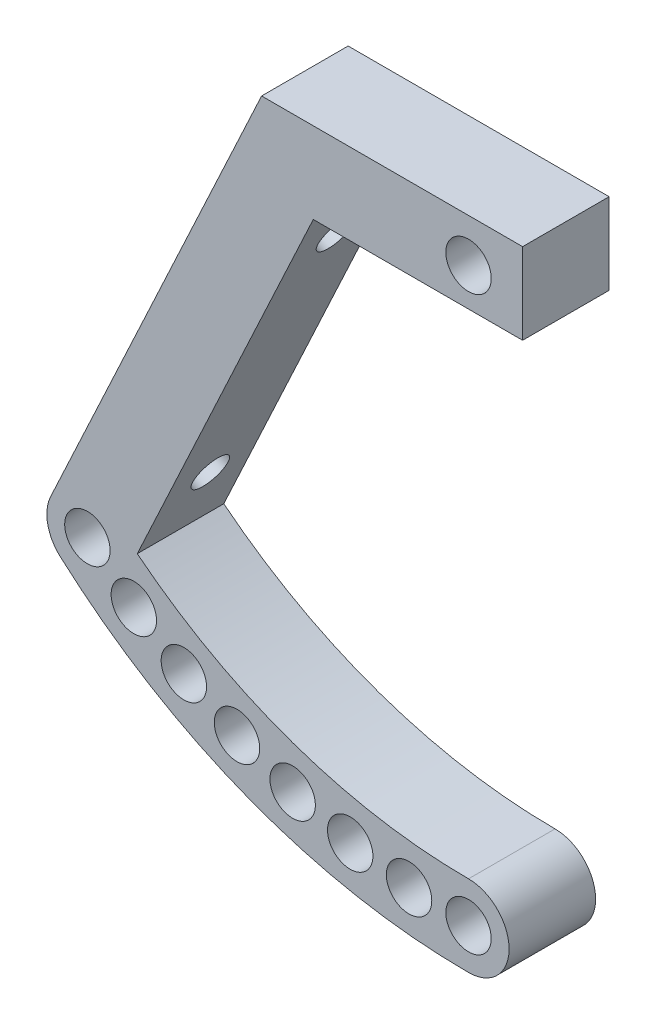
ISO-10303-21;
HEADER;
FILE_DESCRIPTION(('STEP AP214'),'2;1');
FILE_NAME('part.step','',(''),(''),'','','');
FILE_SCHEMA(('AUTOMOTIVE_DESIGN { 1 0 10303 214 1 1 1 1 }'));
ENDSEC;
DATA;
#1=APPLICATION_CONTEXT('core data for automotive mechanical design processes');
#2=APPLICATION_PROTOCOL_DEFINITION('international standard','automotive_design',2000,#1);
#3=PRODUCT_CONTEXT('',#1,'mechanical');
#4=PRODUCT('Part','Part','',(#3));
#5=PRODUCT_RELATED_PRODUCT_CATEGORY('part','',(#4));
#6=PRODUCT_DEFINITION_FORMATION('','',#4);
#7=PRODUCT_DEFINITION_CONTEXT('part definition',#1,'design');
#8=PRODUCT_DEFINITION('design','',#6,#7);
#9=PRODUCT_DEFINITION_SHAPE('','',#8);
#10=(LENGTH_UNIT() NAMED_UNIT(*) SI_UNIT(.MILLI.,.METRE.));
#11=(NAMED_UNIT(*) PLANE_ANGLE_UNIT() SI_UNIT($,.RADIAN.));
#12=(NAMED_UNIT(*) SI_UNIT($,.STERADIAN.) SOLID_ANGLE_UNIT());
#13=UNCERTAINTY_MEASURE_WITH_UNIT(LENGTH_MEASURE(1.E-05),#10,'distance_accuracy_value','');
#14=(GEOMETRIC_REPRESENTATION_CONTEXT(3) GLOBAL_UNCERTAINTY_ASSIGNED_CONTEXT((#13)) GLOBAL_UNIT_ASSIGNED_CONTEXT((#10,
#11,#12)) REPRESENTATION_CONTEXT('',''));
#15=CARTESIAN_POINT('',(0.,0.,0.));
#16=DIRECTION('',(0.,0.,1.));
#17=DIRECTION('',(1.,0.,0.));
#18=AXIS2_PLACEMENT_3D('',#15,#16,#17);
#19=CARTESIAN_POINT('',(-46.3566792332797,21.616474533113,8.));
#20=DIRECTION('',(0.906307787036651,-0.422618261740697,0.));
#21=DIRECTION('',(0.422618261740697,0.906307787036651,0.));
#22=AXIS2_PLACEMENT_3D('',#19,#20,#21);
#23=PLANE('',#22);
#24=CARTESIAN_POINT('',(-23.094691175394,71.5019689080599,4.));
#25=DIRECTION('',(-0.906307787036651,0.422618261740697,0.));
#26=DIRECTION('',(-0.422618261740697,-0.906307787036651,0.));
#27=AXIS2_PLACEMENT_3D('',#24,#25,#26);
#28=CIRCLE('',#27,1.65);
#29=CARTESIAN_POINT('',(-23.7920113072661,70.0065610594495,4.));
#30=VERTEX_POINT('',#29);
#31=EDGE_CURVE('E170',#30,#30,#28,.T.);
#32=ORIENTED_EDGE('',*,*,#31,.F.);
#33=EDGE_LOOP('',(#32));
#34=FACE_BOUND('',#33,.T.);
#35=CARTESIAN_POINT('',(-34.6744315470891,46.6691355432557,4.));
#36=DIRECTION('',(-0.906307787036651,0.422618261740697,0.));
#37=DIRECTION('',(-0.422618261740697,-0.906307787036651,0.));
#38=AXIS2_PLACEMENT_3D('',#35,#36,#37);
#39=CIRCLE('',#38,1.65);
#40=CARTESIAN_POINT('',(-35.3717516789612,45.1737276946452,4.));
#41=VERTEX_POINT('',#40);
#42=EDGE_CURVE('E253',#41,#41,#39,.T.);
#43=ORIENTED_EDGE('',*,*,#42,.F.);
#44=EDGE_LOOP('',(#43));
#45=FACE_BOUND('',#44,.T.);
#46=DIRECTION('',(-0.422618261740697,-0.906307787036651,0.));
#47=VECTOR('',#46,1.);
#48=CARTESIAN_POINT('',(-46.3566792332797,21.616474533113,0.));
#49=LINE('',#48,#47);
#50=CARTESIAN_POINT('',(-19.131994197983,80.,0.));
#51=VERTEX_POINT('',#50);
#52=CARTESIAN_POINT('',(-38.6371285245,38.1711044513156,0.));
#53=VERTEX_POINT('',#52);
#54=EDGE_CURVE('E169',#51,#53,#49,.T.);
#55=ORIENTED_EDGE('',*,*,#54,.T.);
#56=DIRECTION('',(0.,0.,-1.));
#57=VECTOR('',#56,1.);
#58=CARTESIAN_POINT('',(-38.6371285245,38.1711044513156,8.));
#59=LINE('',#58,#57);
#60=CARTESIAN_POINT('',(-38.6371285245,38.1711044513156,8.));
#61=VERTEX_POINT('',#60);
#62=EDGE_CURVE('E11',#61,#53,#59,.T.);
#63=ORIENTED_EDGE('',*,*,#62,.F.);
#64=DIRECTION('',(-0.422618261740697,-0.906307787036651,0.));
#65=VECTOR('',#64,1.);
#66=CARTESIAN_POINT('',(-46.3566792332797,21.616474533113,8.));
#67=LINE('',#66,#65);
#68=CARTESIAN_POINT('',(-19.131994197983,80.,8.));
#69=VERTEX_POINT('',#68);
#70=EDGE_CURVE('E246',#69,#61,#67,.T.);
#71=ORIENTED_EDGE('',*,*,#70,.F.);
#72=DIRECTION('',(0.,0.,-1.));
#73=VECTOR('',#72,1.);
#74=CARTESIAN_POINT('',(-19.131994197983,80.,8.));
#75=LINE('',#74,#73);
#76=EDGE_CURVE('E165',#69,#51,#75,.T.);
#77=ORIENTED_EDGE('',*,*,#76,.T.);
#78=EDGE_LOOP('',(#55,#63,#71,#77));
#79=FACE_BOUND('',#78,.T.);
#80=ADVANCED_FACE('F36',(#34,#45,#79),#23,.F.);
#81=CARTESIAN_POINT('',(-35.2384743231125,36.586285969788,8.));
#82=DIRECTION('',(0.,0.,-1.));
#83=DIRECTION('',(-1.,0.,0.));
#84=AXIS2_PLACEMENT_3D('',#81,#82,#83);
#85=CYLINDRICAL_SURFACE('',#84,3.75);
#86=CARTESIAN_POINT('',(-35.2384743231125,36.586285969788,0.));
#87=DIRECTION('',(0.,0.,1.));
#88=DIRECTION('',(1.,0.,0.));
#89=AXIS2_PLACEMENT_3D('',#86,#87,#88);
#90=CIRCLE('',#89,3.75);
#91=CARTESIAN_POINT('',(-37.7379138053234,33.7906997567076,0.));
#92=VERTEX_POINT('',#91);
#93=EDGE_CURVE('E173',#53,#92,#90,.T.);
#94=ORIENTED_EDGE('',*,*,#93,.T.);
#95=DIRECTION('',(0.,0.,-1.));
#96=VECTOR('',#95,1.);
#97=CARTESIAN_POINT('',(-37.7379138053234,33.7906997567076,8.));
#98=LINE('',#97,#96);
#99=CARTESIAN_POINT('',(-37.7379138053234,33.7906997567076,8.));
#100=VERTEX_POINT('',#99);
#101=EDGE_CURVE('E45',#100,#92,#98,.T.);
#102=ORIENTED_EDGE('',*,*,#101,.F.);
#103=CARTESIAN_POINT('',(-35.2384743231125,36.586285969788,8.));
#104=DIRECTION('',(0.,0.,1.));
#105=DIRECTION('',(1.,0.,0.));
#106=AXIS2_PLACEMENT_3D('',#103,#104,#105);
#107=CIRCLE('',#106,3.75);
#108=EDGE_CURVE('E98',#61,#100,#107,.T.);
#109=ORIENTED_EDGE('',*,*,#108,.F.);
#110=ORIENTED_EDGE('',*,*,#62,.T.);
#111=EDGE_LOOP('',(#94,#102,#109,#110));
#112=FACE_BOUND('',#111,.T.);
#113=ADVANCED_FACE('F266',(#112),#85,.T.);
#114=CARTESIAN_POINT('',(0.,76.,8.));
#115=DIRECTION('',(0.,0.,-1.));
#116=DIRECTION('',(-1.,0.,0.));
#117=AXIS2_PLACEMENT_3D('',#114,#115,#116);
#118=CYLINDRICAL_SURFACE('',#117,56.6195652173913);
#119=CARTESIAN_POINT('',(0.,76.,0.));
#120=DIRECTION('',(0.,0.,1.));
#121=DIRECTION('',(1.,0.,0.));
#122=AXIS2_PLACEMENT_3D('',#119,#120,#121);
#123=CIRCLE('',#122,56.6195652173913);
#124=CARTESIAN_POINT('',(-6.22100093414468E-13,19.3804347826087,0.));
#125=VERTEX_POINT('',#124);
#126=EDGE_CURVE('E175',#92,#125,#123,.T.);
#127=ORIENTED_EDGE('',*,*,#126,.T.);
#128=DIRECTION('',(0.,0.,-1.));
#129=VECTOR('',#128,1.);
#130=CARTESIAN_POINT('',(-6.22100093414468E-13,19.3804347826087,8.));
#131=LINE('',#130,#129);
#132=CARTESIAN_POINT('',(-6.22100093414468E-13,19.3804347826087,8.));
#133=VERTEX_POINT('',#132);
#134=EDGE_CURVE('E221',#133,#125,#131,.T.);
#135=ORIENTED_EDGE('',*,*,#134,.F.);
#136=CARTESIAN_POINT('',(0.,76.,8.));
#137=DIRECTION('',(0.,0.,1.));
#138=DIRECTION('',(1.,0.,0.));
#139=AXIS2_PLACEMENT_3D('',#136,#137,#138);
#140=CIRCLE('',#139,56.6195652173913);
#141=EDGE_CURVE('E229',#100,#133,#140,.T.);
#142=ORIENTED_EDGE('',*,*,#141,.F.);
#143=ORIENTED_EDGE('',*,*,#101,.T.);
#144=EDGE_LOOP('',(#127,#135,#142,#143));
#145=FACE_BOUND('',#144,.T.);
#146=ADVANCED_FACE('F227',(#145),#118,.T.);
#147=CARTESIAN_POINT('',(-5.50774703622636E-13,23.1304347826087,8.));
#148=DIRECTION('',(0.,0.,-1.));
#149=DIRECTION('',(-1.,0.,0.));
#150=AXIS2_PLACEMENT_3D('',#147,#148,#149);
#151=CYLINDRICAL_SURFACE('',#150,3.74999999999999);
#152=CARTESIAN_POINT('',(-5.50774703622636E-13,23.1304347826087,0.));
#153=DIRECTION('',(0.,0.,1.));
#154=DIRECTION('',(1.,0.,0.));
#155=AXIS2_PLACEMENT_3D('',#152,#153,#154);
#156=CIRCLE('',#155,3.74999999999999);
#157=CARTESIAN_POINT('',(-5.40786307992416E-13,26.8804347826087,0.));
#158=VERTEX_POINT('',#157);
#159=EDGE_CURVE('E177',#125,#158,#156,.T.);
#160=ORIENTED_EDGE('',*,*,#159,.T.);
#161=DIRECTION('',(0.,0.,-1.));
#162=VECTOR('',#161,1.);
#163=CARTESIAN_POINT('',(-5.40786307992416E-13,26.8804347826087,8.));
#164=LINE('',#163,#162);
#165=CARTESIAN_POINT('',(-5.40786307992416E-13,26.8804347826087,8.));
#166=VERTEX_POINT('',#165);
#167=EDGE_CURVE('E219',#166,#158,#164,.T.);
#168=ORIENTED_EDGE('',*,*,#167,.F.);
#169=CARTESIAN_POINT('',(-5.50774703622636E-13,23.1304347826087,8.));
#170=DIRECTION('',(0.,0.,1.));
#171=DIRECTION('',(1.,0.,0.));
#172=AXIS2_PLACEMENT_3D('',#169,#170,#171);
#173=CIRCLE('',#172,3.74999999999999);
#174=EDGE_CURVE('E241',#133,#166,#173,.T.);
#175=ORIENTED_EDGE('',*,*,#174,.F.);
#176=ORIENTED_EDGE('',*,*,#134,.T.);
#177=EDGE_LOOP('',(#160,#168,#175,#176));
#178=FACE_BOUND('',#177,.T.);
#179=ADVANCED_FACE('F238',(#178),#151,.T.);
#180=CARTESIAN_POINT('',(0.,76.,8.));
#181=DIRECTION('',(0.,0.,-1.));
#182=DIRECTION('',(-1.,0.,0.));
#183=AXIS2_PLACEMENT_3D('',#180,#181,#182);
#184=CYLINDRICAL_SURFACE('',#183,49.1195652173913);
#185=CARTESIAN_POINT('',(0.,76.,0.));
#186=DIRECTION('',(0.,0.,1.));
#187=DIRECTION('',(1.,0.,0.));
#188=AXIS2_PLACEMENT_3D('',#185,#186,#187);
#189=CIRCLE('',#188,49.1195652173913);
#190=CARTESIAN_POINT('',(-30.6285068063964,37.5991372758881,0.));
#191=VERTEX_POINT('',#190);
#192=EDGE_CURVE('E180',#191,#158,#189,.T.);
#193=ORIENTED_EDGE('',*,*,#192,.F.);
#194=DIRECTION('',(0.,0.,-1.));
#195=VECTOR('',#194,1.);
#196=CARTESIAN_POINT('',(-30.6285068063964,37.5991372758881,8.));
#197=LINE('',#196,#195);
#198=CARTESIAN_POINT('',(-30.6285068063964,37.5991372758881,8.));
#199=VERTEX_POINT('',#198);
#200=EDGE_CURVE('E217',#199,#191,#197,.T.);
#201=ORIENTED_EDGE('',*,*,#200,.F.);
#202=CARTESIAN_POINT('',(0.,76.,8.));
#203=DIRECTION('',(0.,0.,1.));
#204=DIRECTION('',(1.,0.,0.));
#205=AXIS2_PLACEMENT_3D('',#202,#203,#204);
#206=CIRCLE('',#205,49.1195652173913);
#207=EDGE_CURVE('E136',#199,#166,#206,.T.);
#208=ORIENTED_EDGE('',*,*,#207,.T.);
#209=ORIENTED_EDGE('',*,*,#167,.T.);
#210=EDGE_LOOP('',(#193,#201,#208,#209));
#211=FACE_BOUND('',#210,.T.);
#212=ADVANCED_FACE('F275',(#211),#184,.F.);
#213=CARTESIAN_POINT('',(-39.5593708305048,18.4468375700577,8.));
#214=DIRECTION('',(0.906307787036651,-0.422618261740697,0.));
#215=DIRECTION('',(0.422618261740697,0.906307787036651,0.));
#216=AXIS2_PLACEMENT_3D('',#213,#214,#215);
#217=PLANE('',#216);
#218=CARTESIAN_POINT('',(-16.2973827726191,68.3323319450047,4.));
#219=DIRECTION('',(0.906307787036651,-0.422618261740697,0.));
#220=DIRECTION('',(0.422618261740697,0.906307787036651,0.));
#221=AXIS2_PLACEMENT_3D('',#218,#219,#220);
#222=CIRCLE('',#221,1.65);
#223=CARTESIAN_POINT('',(-15.6000626407469,69.8277397936152,4.));
#224=VERTEX_POINT('',#223);
#225=EDGE_CURVE('E256',#224,#224,#222,.F.);
#226=ORIENTED_EDGE('',*,*,#225,.T.);
#227=EDGE_LOOP('',(#226));
#228=FACE_BOUND('',#227,.T.);
#229=CARTESIAN_POINT('',(-27.8771231443142,43.4994985802004,4.));
#230=DIRECTION('',(0.906307787036651,-0.422618261740697,0.));
#231=DIRECTION('',(0.422618261740697,0.906307787036651,0.));
#232=AXIS2_PLACEMENT_3D('',#229,#230,#231);
#233=CIRCLE('',#232,1.65);
#234=CARTESIAN_POINT('',(-27.179803012442,44.9949064288109,4.));
#235=VERTEX_POINT('',#234);
#236=EDGE_CURVE('E250',#235,#235,#233,.F.);
#237=ORIENTED_EDGE('',*,*,#236,.T.);
#238=EDGE_LOOP('',(#237));
#239=FACE_BOUND('',#238,.T.);
#240=DIRECTION('',(-0.422618261740697,-0.906307787036651,0.));
#241=VECTOR('',#240,1.);
#242=CARTESIAN_POINT('',(-39.5593708305048,18.4468375700577,0.));
#243=LINE('',#242,#241);
#244=CARTESIAN_POINT('',(-14.3539672419268,72.5,0.));
#245=VERTEX_POINT('',#244);
#246=EDGE_CURVE('E183',#245,#191,#243,.T.);
#247=ORIENTED_EDGE('',*,*,#246,.F.);
#248=DIRECTION('',(0.,0.,-1.));
#249=VECTOR('',#248,1.);
#250=CARTESIAN_POINT('',(-14.3539672419268,72.5,8.));
#251=LINE('',#250,#249);
#252=CARTESIAN_POINT('',(-14.3539672419268,72.5,8.));
#253=VERTEX_POINT('',#252);
#254=EDGE_CURVE('E123',#253,#245,#251,.T.);
#255=ORIENTED_EDGE('',*,*,#254,.F.);
#256=DIRECTION('',(-0.422618261740697,-0.906307787036651,0.));
#257=VECTOR('',#256,1.);
#258=CARTESIAN_POINT('',(-39.5593708305048,18.4468375700577,8.));
#259=LINE('',#258,#257);
#260=EDGE_CURVE('E134',#253,#199,#259,.T.);
#261=ORIENTED_EDGE('',*,*,#260,.T.);
#262=ORIENTED_EDGE('',*,*,#200,.T.);
#263=EDGE_LOOP('',(#247,#255,#261,#262));
#264=FACE_BOUND('',#263,.T.);
#265=ADVANCED_FACE('F273',(#228,#239,#264),#217,.T.);
#266=CARTESIAN_POINT('',(0.,72.5,8.));
#267=DIRECTION('',(0.,-1.,0.));
#268=DIRECTION('',(0.,0.,-1.));
#269=AXIS2_PLACEMENT_3D('',#266,#267,#268);
#270=PLANE('',#269);
#271=DIRECTION('',(-1.,0.,0.));
#272=VECTOR('',#271,1.);
#273=CARTESIAN_POINT('',(0.,72.5,0.));
#274=LINE('',#273,#272);
#275=CARTESIAN_POINT('',(5.00000000000002,72.5,0.));
#276=VERTEX_POINT('',#275);
#277=EDGE_CURVE('E122',#276,#245,#274,.T.);
#278=ORIENTED_EDGE('',*,*,#277,.F.);
#279=DIRECTION('',(0.,0.,-1.));
#280=VECTOR('',#279,1.);
#281=CARTESIAN_POINT('',(5.00000000000002,72.5,8.));
#282=LINE('',#281,#280);
#283=CARTESIAN_POINT('',(5.00000000000002,72.5,8.));
#284=VERTEX_POINT('',#283);
#285=EDGE_CURVE('E116',#284,#276,#282,.T.);
#286=ORIENTED_EDGE('',*,*,#285,.F.);
#287=DIRECTION('',(-1.,0.,0.));
#288=VECTOR('',#287,1.);
#289=CARTESIAN_POINT('',(0.,72.5,8.));
#290=LINE('',#289,#288);
#291=EDGE_CURVE('E120',#284,#253,#290,.T.);
#292=ORIENTED_EDGE('',*,*,#291,.T.);
#293=ORIENTED_EDGE('',*,*,#254,.T.);
#294=EDGE_LOOP('',(#278,#286,#292,#293));
#295=FACE_BOUND('',#294,.T.);
#296=ADVANCED_FACE('F118',(#295),#270,.T.);
#297=CARTESIAN_POINT('',(5.00000000000004,0.,8.));
#298=DIRECTION('',(-1.,0.,0.));
#299=DIRECTION('',(0.,-1.,0.));
#300=AXIS2_PLACEMENT_3D('',#297,#298,#299);
#301=PLANE('',#300);
#302=DIRECTION('',(0.,1.,0.));
#303=VECTOR('',#302,1.);
#304=CARTESIAN_POINT('',(5.00000000000004,0.,0.));
#305=LINE('',#304,#303);
#306=CARTESIAN_POINT('',(5.00000000000002,80.,0.));
#307=VERTEX_POINT('',#306);
#308=EDGE_CURVE('E84',#276,#307,#305,.T.);
#309=ORIENTED_EDGE('',*,*,#308,.T.);
#310=DIRECTION('',(0.,0.,-1.));
#311=VECTOR('',#310,1.);
#312=CARTESIAN_POINT('',(5.00000000000002,80.,8.));
#313=LINE('',#312,#311);
#314=CARTESIAN_POINT('',(5.00000000000002,80.,8.));
#315=VERTEX_POINT('',#314);
#316=EDGE_CURVE('E124',#315,#307,#313,.T.);
#317=ORIENTED_EDGE('',*,*,#316,.F.);
#318=DIRECTION('',(0.,1.,0.));
#319=VECTOR('',#318,1.);
#320=CARTESIAN_POINT('',(5.00000000000004,0.,8.));
#321=LINE('',#320,#319);
#322=EDGE_CURVE('E126',#284,#315,#321,.T.);
#323=ORIENTED_EDGE('',*,*,#322,.F.);
#324=ORIENTED_EDGE('',*,*,#285,.T.);
#325=EDGE_LOOP('',(#309,#317,#323,#324));
#326=FACE_BOUND('',#325,.T.);
#327=ADVANCED_FACE('F127',(#326),#301,.F.);
#328=CARTESIAN_POINT('',(-5.5,23.4172944184498,8.));
#329=DIRECTION('',(0.,0.,-1.));
#330=DIRECTION('',(-1.,0.,0.));
#331=AXIS2_PLACEMENT_3D('',#328,#329,#330);
#332=CYLINDRICAL_SURFACE('',#331,2.1);
#333=CARTESIAN_POINT('',(-5.5,23.4172944184498,8.));
#334=DIRECTION('',(0.,0.,1.));
#335=DIRECTION('',(1.,0.,0.));
#336=AXIS2_PLACEMENT_3D('',#333,#334,#335);
#337=CIRCLE('',#336,2.1);
#338=CARTESIAN_POINT('',(-3.39999999999999,23.4172944184498,8.));
#339=VERTEX_POINT('',#338);
#340=EDGE_CURVE('E159',#339,#339,#337,.T.);
#341=ORIENTED_EDGE('',*,*,#340,.T.);
#342=EDGE_LOOP('',(#341));
#343=FACE_BOUND('',#342,.T.);
#344=CARTESIAN_POINT('',(-5.5,23.4172944184498,0.));
#345=DIRECTION('',(0.,0.,1.));
#346=DIRECTION('',(1.,0.,0.));
#347=AXIS2_PLACEMENT_3D('',#344,#345,#346);
#348=CIRCLE('',#347,2.1);
#349=CARTESIAN_POINT('',(-3.39999999999999,23.4172944184498,0.));
#350=VERTEX_POINT('',#349);
#351=EDGE_CURVE('E207',#350,#350,#348,.T.);
#352=ORIENTED_EDGE('',*,*,#351,.F.);
#353=EDGE_LOOP('',(#352));
#354=FACE_BOUND('',#353,.T.);
#355=ADVANCED_FACE('F323',(#343,#354),#332,.F.);
#356=CARTESIAN_POINT('',(-10.940316210635,24.2747604405034,8.));
#357=DIRECTION('',(0.,0.,-1.));
#358=DIRECTION('',(-1.,0.,0.));
#359=AXIS2_PLACEMENT_3D('',#356,#357,#358);
#360=CYLINDRICAL_SURFACE('',#359,2.1);
#361=CARTESIAN_POINT('',(-10.940316210635,24.2747604405034,8.));
#362=DIRECTION('',(0.,0.,1.));
#363=DIRECTION('',(1.,0.,0.));
#364=AXIS2_PLACEMENT_3D('',#361,#362,#363);
#365=CIRCLE('',#364,2.1);
#366=CARTESIAN_POINT('',(-8.84031621063503,24.2747604405034,8.));
#367=VERTEX_POINT('',#366);
#368=EDGE_CURVE('E156',#367,#367,#365,.T.);
#369=ORIENTED_EDGE('',*,*,#368,.T.);
#370=EDGE_LOOP('',(#369));
#371=FACE_BOUND('',#370,.T.);
#372=CARTESIAN_POINT('',(-10.940316210635,24.2747604405034,0.));
#373=DIRECTION('',(0.,0.,1.));
#374=DIRECTION('',(1.,0.,0.));
#375=AXIS2_PLACEMENT_3D('',#372,#373,#374);
#376=CIRCLE('',#375,2.1);
#377=CARTESIAN_POINT('',(-8.84031621063503,24.2747604405034,0.));
#378=VERTEX_POINT('',#377);
#379=EDGE_CURVE('E204',#378,#378,#376,.T.);
#380=ORIENTED_EDGE('',*,*,#379,.F.);
#381=EDGE_LOOP('',(#380));
#382=FACE_BOUND('',#381,.T.);
#383=ADVANCED_FACE('F332',(#371,#382),#360,.F.);
#384=CARTESIAN_POINT('',(-16.2619125070334,25.6935279721428,8.));
#385=DIRECTION('',(0.,0.,-1.));
#386=DIRECTION('',(-1.,0.,0.));
#387=AXIS2_PLACEMENT_3D('',#384,#385,#386);
#388=CYLINDRICAL_SURFACE('',#387,2.1);
#389=CARTESIAN_POINT('',(-16.2619125070334,25.6935279721428,8.));
#390=DIRECTION('',(0.,0.,1.));
#391=DIRECTION('',(1.,0.,0.));
#392=AXIS2_PLACEMENT_3D('',#389,#390,#391);
#393=CIRCLE('',#392,2.1);
#394=CARTESIAN_POINT('',(-14.1619125070334,25.6935279721428,8.));
#395=VERTEX_POINT('',#394);
#396=EDGE_CURVE('E153',#395,#395,#393,.T.);
#397=ORIENTED_EDGE('',*,*,#396,.T.);
#398=EDGE_LOOP('',(#397));
#399=FACE_BOUND('',#398,.T.);
#400=CARTESIAN_POINT('',(-16.2619125070334,25.6935279721428,0.));
#401=DIRECTION('',(0.,0.,1.));
#402=DIRECTION('',(1.,0.,0.));
#403=AXIS2_PLACEMENT_3D('',#400,#401,#402);
#404=CIRCLE('',#403,2.1);
#405=CARTESIAN_POINT('',(-14.1619125070334,25.6935279721428,0.));
#406=VERTEX_POINT('',#405);
#407=EDGE_CURVE('E201',#406,#406,#404,.T.);
#408=ORIENTED_EDGE('',*,*,#407,.F.);
#409=EDGE_LOOP('',(#408));
#410=FACE_BOUND('',#409,.T.);
#411=ADVANCED_FACE('F342',(#399,#410),#388,.F.);
#412=CARTESIAN_POINT('',(-21.4070410651152,27.6582011183648,8.));
#413=DIRECTION('',(0.,0.,-1.));
#414=DIRECTION('',(-1.,0.,0.));
#415=AXIS2_PLACEMENT_3D('',#412,#413,#414);
#416=CYLINDRICAL_SURFACE('',#415,2.1);
#417=CARTESIAN_POINT('',(-21.4070410651152,27.6582011183648,8.));
#418=DIRECTION('',(0.,0.,1.));
#419=DIRECTION('',(1.,0.,0.));
#420=AXIS2_PLACEMENT_3D('',#417,#418,#419);
#421=CIRCLE('',#420,2.1);
#422=CARTESIAN_POINT('',(-19.3070410651152,27.6582011183648,8.));
#423=VERTEX_POINT('',#422);
#424=EDGE_CURVE('E150',#423,#423,#421,.T.);
#425=ORIENTED_EDGE('',*,*,#424,.T.);
#426=EDGE_LOOP('',(#425));
#427=FACE_BOUND('',#426,.T.);
#428=CARTESIAN_POINT('',(-21.4070410651152,27.6582011183648,0.));
#429=DIRECTION('',(0.,0.,1.));
#430=DIRECTION('',(1.,0.,0.));
#431=AXIS2_PLACEMENT_3D('',#428,#429,#430);
#432=CIRCLE('',#431,2.1);
#433=CARTESIAN_POINT('',(-19.3070410651152,27.6582011183648,0.));
#434=VERTEX_POINT('',#433);
#435=EDGE_CURVE('E198',#434,#434,#432,.T.);
#436=ORIENTED_EDGE('',*,*,#435,.F.);
#437=EDGE_LOOP('',(#436));
#438=FACE_BOUND('',#437,.T.);
#439=ADVANCED_FACE('F352',(#427,#438),#416,.F.);
#440=CARTESIAN_POINT('',(-26.3198690177684,30.1474600358551,8.));
#441=DIRECTION('',(0.,0.,-1.));
#442=DIRECTION('',(-1.,0.,0.));
#443=AXIS2_PLACEMENT_3D('',#440,#441,#442);
#444=CYLINDRICAL_SURFACE('',#443,2.10000000000001);
#445=CARTESIAN_POINT('',(-26.3198690177684,30.1474600358551,8.));
#446=DIRECTION('',(0.,0.,1.));
#447=DIRECTION('',(1.,0.,0.));
#448=AXIS2_PLACEMENT_3D('',#445,#446,#447);
#449=CIRCLE('',#448,2.10000000000001);
#450=CARTESIAN_POINT('',(-24.2198690177684,30.1474600358551,8.));
#451=VERTEX_POINT('',#450);
#452=EDGE_CURVE('E147',#451,#451,#449,.T.);
#453=ORIENTED_EDGE('',*,*,#452,.T.);
#454=EDGE_LOOP('',(#453));
#455=FACE_BOUND('',#454,.T.);
#456=CARTESIAN_POINT('',(-26.3198690177684,30.1474600358551,0.));
#457=DIRECTION('',(0.,0.,1.));
#458=DIRECTION('',(1.,0.,0.));
#459=AXIS2_PLACEMENT_3D('',#456,#457,#458);
#460=CIRCLE('',#459,2.10000000000001);
#461=CARTESIAN_POINT('',(-24.2198690177684,30.1474600358551,0.));
#462=VERTEX_POINT('',#461);
#463=EDGE_CURVE('E195',#462,#462,#460,.T.);
#464=ORIENTED_EDGE('',*,*,#463,.F.);
#465=EDGE_LOOP('',(#464));
#466=FACE_BOUND('',#465,.T.);
#467=ADVANCED_FACE('F362',(#455,#466),#444,.F.);
#468=CARTESIAN_POINT('',(-35.2384743231125,36.586285969788,8.));
#469=DIRECTION('',(0.,0.,-1.));
#470=DIRECTION('',(-1.,0.,0.));
#471=AXIS2_PLACEMENT_3D('',#468,#469,#470);
#472=CYLINDRICAL_SURFACE('',#471,2.1);
#473=CARTESIAN_POINT('',(-35.2384743231125,36.586285969788,8.));
#474=DIRECTION('',(0.,0.,1.));
#475=DIRECTION('',(1.,0.,0.));
#476=AXIS2_PLACEMENT_3D('',#473,#474,#475);
#477=CIRCLE('',#476,2.1);
#478=CARTESIAN_POINT('',(-33.1384743231125,36.586285969788,8.));
#479=VERTEX_POINT('',#478);
#480=EDGE_CURVE('E144',#479,#479,#477,.T.);
#481=ORIENTED_EDGE('',*,*,#480,.T.);
#482=EDGE_LOOP('',(#481));
#483=FACE_BOUND('',#482,.T.);
#484=CARTESIAN_POINT('',(-35.2384743231125,36.586285969788,0.));
#485=DIRECTION('',(0.,0.,1.));
#486=DIRECTION('',(1.,0.,0.));
#487=AXIS2_PLACEMENT_3D('',#484,#485,#486);
#488=CIRCLE('',#487,2.1);
#489=CARTESIAN_POINT('',(-33.1384743231125,36.586285969788,0.));
#490=VERTEX_POINT('',#489);
#491=EDGE_CURVE('E192',#490,#490,#488,.T.);
#492=ORIENTED_EDGE('',*,*,#491,.F.);
#493=EDGE_LOOP('',(#492));
#494=FACE_BOUND('',#493,.T.);
#495=ADVANCED_FACE('F372',(#483,#494),#472,.F.);
#496=CARTESIAN_POINT('',(0.,76.,8.));
#497=DIRECTION('',(0.,0.,-1.));
#498=DIRECTION('',(-1.,0.,0.));
#499=AXIS2_PLACEMENT_3D('',#496,#497,#498);
#500=CYLINDRICAL_SURFACE('',#499,2.09999999999985);
#501=CARTESIAN_POINT('',(0.,76.,8.));
#502=DIRECTION('',(0.,0.,1.));
#503=DIRECTION('',(1.,0.,0.));
#504=AXIS2_PLACEMENT_3D('',#501,#502,#503);
#505=CIRCLE('',#504,2.09999999999985);
#506=CARTESIAN_POINT('',(2.09999999999985,76.,8.));
#507=VERTEX_POINT('',#506);
#508=EDGE_CURVE('E141',#507,#507,#505,.T.);
#509=ORIENTED_EDGE('',*,*,#508,.T.);
#510=EDGE_LOOP('',(#509));
#511=FACE_BOUND('',#510,.T.);
#512=CARTESIAN_POINT('',(0.,76.,0.));
#513=DIRECTION('',(0.,0.,1.));
#514=DIRECTION('',(1.,0.,0.));
#515=AXIS2_PLACEMENT_3D('',#512,#513,#514);
#516=CIRCLE('',#515,2.09999999999985);
#517=CARTESIAN_POINT('',(2.09999999999985,76.,0.));
#518=VERTEX_POINT('',#517);
#519=EDGE_CURVE('E189',#518,#518,#516,.T.);
#520=ORIENTED_EDGE('',*,*,#519,.F.);
#521=EDGE_LOOP('',(#520));
#522=FACE_BOUND('',#521,.T.);
#523=ADVANCED_FACE('F382',(#511,#522),#500,.F.);
#524=CARTESIAN_POINT('',(0.,80.,8.));
#525=DIRECTION('',(0.,-1.,0.));
#526=DIRECTION('',(0.,0.,-1.));
#527=AXIS2_PLACEMENT_3D('',#524,#525,#526);
#528=PLANE('',#527);
#529=DIRECTION('',(-1.,0.,0.));
#530=VECTOR('',#529,1.);
#531=CARTESIAN_POINT('',(0.,80.,0.));
#532=LINE('',#531,#530);
#533=EDGE_CURVE('E90',#307,#51,#532,.T.);
#534=ORIENTED_EDGE('',*,*,#533,.T.);
#535=ORIENTED_EDGE('',*,*,#76,.F.);
#536=DIRECTION('',(-1.,0.,0.));
#537=VECTOR('',#536,1.);
#538=CARTESIAN_POINT('',(0.,80.,8.));
#539=LINE('',#538,#537);
#540=EDGE_CURVE('E53',#315,#69,#539,.T.);
#541=ORIENTED_EDGE('',*,*,#540,.F.);
#542=ORIENTED_EDGE('',*,*,#316,.T.);
#543=EDGE_LOOP('',(#534,#535,#541,#542));
#544=FACE_BOUND('',#543,.T.);
#545=ADVANCED_FACE('F392',(#544),#528,.F.);
#546=CARTESIAN_POINT('',(-30.9470843306816,33.1342922873577,8.));
#547=DIRECTION('',(0.,0.,-1.));
#548=DIRECTION('',(-1.,0.,0.));
#549=AXIS2_PLACEMENT_3D('',#546,#547,#548);
#550=CYLINDRICAL_SURFACE('',#549,2.10000000000002);
#551=CARTESIAN_POINT('',(-30.9470843306816,33.1342922873577,8.));
#552=DIRECTION('',(0.,0.,1.));
#553=DIRECTION('',(1.,0.,0.));
#554=AXIS2_PLACEMENT_3D('',#551,#552,#553);
#555=CIRCLE('',#554,2.10000000000002);
#556=CARTESIAN_POINT('',(-28.8470843306815,33.1342922873577,8.));
#557=VERTEX_POINT('',#556);
#558=EDGE_CURVE('E213',#557,#557,#555,.T.);
#559=ORIENTED_EDGE('',*,*,#558,.T.);
#560=EDGE_LOOP('',(#559));
#561=FACE_BOUND('',#560,.T.);
#562=CARTESIAN_POINT('',(-30.9470843306816,33.1342922873577,0.));
#563=DIRECTION('',(0.,0.,1.));
#564=DIRECTION('',(1.,0.,0.));
#565=AXIS2_PLACEMENT_3D('',#562,#563,#564);
#566=CIRCLE('',#565,2.10000000000002);
#567=CARTESIAN_POINT('',(-28.8470843306815,33.1342922873577,0.));
#568=VERTEX_POINT('',#567);
#569=EDGE_CURVE('E166',#568,#568,#566,.T.);
#570=ORIENTED_EDGE('',*,*,#569,.F.);
#571=EDGE_LOOP('',(#570));
#572=FACE_BOUND('',#571,.T.);
#573=ADVANCED_FACE('F38',(#561,#572),#550,.F.);
#574=CARTESIAN_POINT('',(-5.50774703622636E-13,23.1304347826087,8.));
#575=DIRECTION('',(0.,0.,-1.));
#576=DIRECTION('',(-1.,0.,0.));
#577=AXIS2_PLACEMENT_3D('',#574,#575,#576);
#578=CYLINDRICAL_SURFACE('',#577,2.10000000000001);
#579=CARTESIAN_POINT('',(-5.50774703622636E-13,23.1304347826087,8.));
#580=DIRECTION('',(0.,0.,1.));
#581=DIRECTION('',(1.,0.,0.));
#582=AXIS2_PLACEMENT_3D('',#579,#580,#581);
#583=CIRCLE('',#582,2.10000000000001);
#584=CARTESIAN_POINT('',(2.09999999999945,23.1304347826087,8.));
#585=VERTEX_POINT('',#584);
#586=EDGE_CURVE('E162',#585,#585,#583,.T.);
#587=ORIENTED_EDGE('',*,*,#586,.T.);
#588=EDGE_LOOP('',(#587));
#589=FACE_BOUND('',#588,.T.);
#590=CARTESIAN_POINT('',(-5.50774703622636E-13,23.1304347826087,0.));
#591=DIRECTION('',(0.,0.,1.));
#592=DIRECTION('',(1.,0.,0.));
#593=AXIS2_PLACEMENT_3D('',#590,#591,#592);
#594=CIRCLE('',#593,2.10000000000001);
#595=CARTESIAN_POINT('',(2.09999999999945,23.1304347826087,0.));
#596=VERTEX_POINT('',#595);
#597=EDGE_CURVE('E210',#596,#596,#594,.T.);
#598=ORIENTED_EDGE('',*,*,#597,.F.);
#599=EDGE_LOOP('',(#598));
#600=FACE_BOUND('',#599,.T.);
#601=ADVANCED_FACE('F410',(#589,#600),#578,.F.);
#602=CARTESIAN_POINT('',(0.,0.,8.));
#603=DIRECTION('',(0.,0.,1.));
#604=DIRECTION('',(1.,0.,0.));
#605=AXIS2_PLACEMENT_3D('',#602,#603,#604);
#606=PLANE('',#605);
#607=ORIENTED_EDGE('',*,*,#558,.F.);
#608=EDGE_LOOP('',(#607));
#609=FACE_BOUND('',#608,.T.);
#610=ORIENTED_EDGE('',*,*,#70,.T.);
#611=ORIENTED_EDGE('',*,*,#108,.T.);
#612=ORIENTED_EDGE('',*,*,#141,.T.);
#613=ORIENTED_EDGE('',*,*,#174,.T.);
#614=ORIENTED_EDGE('',*,*,#207,.F.);
#615=ORIENTED_EDGE('',*,*,#260,.F.);
#616=ORIENTED_EDGE('',*,*,#291,.F.);
#617=ORIENTED_EDGE('',*,*,#322,.T.);
#618=ORIENTED_EDGE('',*,*,#540,.T.);
#619=EDGE_LOOP('',(#610,#611,#612,#613,#614,#615,#616,#617,#618));
#620=FACE_BOUND('',#619,.T.);
#621=ORIENTED_EDGE('',*,*,#508,.F.);
#622=EDGE_LOOP('',(#621));
#623=FACE_BOUND('',#622,.T.);
#624=ORIENTED_EDGE('',*,*,#480,.F.);
#625=EDGE_LOOP('',(#624));
#626=FACE_BOUND('',#625,.T.);
#627=ORIENTED_EDGE('',*,*,#452,.F.);
#628=EDGE_LOOP('',(#627));
#629=FACE_BOUND('',#628,.T.);
#630=ORIENTED_EDGE('',*,*,#424,.F.);
#631=EDGE_LOOP('',(#630));
#632=FACE_BOUND('',#631,.T.);
#633=ORIENTED_EDGE('',*,*,#396,.F.);
#634=EDGE_LOOP('',(#633));
#635=FACE_BOUND('',#634,.T.);
#636=ORIENTED_EDGE('',*,*,#368,.F.);
#637=EDGE_LOOP('',(#636));
#638=FACE_BOUND('',#637,.T.);
#639=ORIENTED_EDGE('',*,*,#340,.F.);
#640=EDGE_LOOP('',(#639));
#641=FACE_BOUND('',#640,.T.);
#642=ORIENTED_EDGE('',*,*,#586,.F.);
#643=EDGE_LOOP('',(#642));
#644=FACE_BOUND('',#643,.T.);
#645=ADVANCED_FACE('F130',(#609,#620,#623,#626,#629,#632,#635,#638,#641,#644),#606,.T.);
#646=CARTESIAN_POINT('',(0.,0.,0.));
#647=DIRECTION('',(0.,0.,1.));
#648=DIRECTION('',(1.,0.,0.));
#649=AXIS2_PLACEMENT_3D('',#646,#647,#648);
#650=PLANE('',#649);
#651=ORIENTED_EDGE('',*,*,#569,.T.);
#652=EDGE_LOOP('',(#651));
#653=FACE_BOUND('',#652,.T.);
#654=ORIENTED_EDGE('',*,*,#54,.F.);
#655=ORIENTED_EDGE('',*,*,#533,.F.);
#656=ORIENTED_EDGE('',*,*,#308,.F.);
#657=ORIENTED_EDGE('',*,*,#277,.T.);
#658=ORIENTED_EDGE('',*,*,#246,.T.);
#659=ORIENTED_EDGE('',*,*,#192,.T.);
#660=ORIENTED_EDGE('',*,*,#159,.F.);
#661=ORIENTED_EDGE('',*,*,#126,.F.);
#662=ORIENTED_EDGE('',*,*,#93,.F.);
#663=EDGE_LOOP('',(#654,#655,#656,#657,#658,#659,#660,#661,#662));
#664=FACE_BOUND('',#663,.T.);
#665=ORIENTED_EDGE('',*,*,#519,.T.);
#666=EDGE_LOOP('',(#665));
#667=FACE_BOUND('',#666,.T.);
#668=ORIENTED_EDGE('',*,*,#491,.T.);
#669=EDGE_LOOP('',(#668));
#670=FACE_BOUND('',#669,.T.);
#671=ORIENTED_EDGE('',*,*,#463,.T.);
#672=EDGE_LOOP('',(#671));
#673=FACE_BOUND('',#672,.T.);
#674=ORIENTED_EDGE('',*,*,#435,.T.);
#675=EDGE_LOOP('',(#674));
#676=FACE_BOUND('',#675,.T.);
#677=ORIENTED_EDGE('',*,*,#407,.T.);
#678=EDGE_LOOP('',(#677));
#679=FACE_BOUND('',#678,.T.);
#680=ORIENTED_EDGE('',*,*,#379,.T.);
#681=EDGE_LOOP('',(#680));
#682=FACE_BOUND('',#681,.T.);
#683=ORIENTED_EDGE('',*,*,#351,.T.);
#684=EDGE_LOOP('',(#683));
#685=FACE_BOUND('',#684,.T.);
#686=ORIENTED_EDGE('',*,*,#597,.T.);
#687=EDGE_LOOP('',(#686));
#688=FACE_BOUND('',#687,.T.);
#689=ADVANCED_FACE('F233',(#653,#664,#667,#670,#673,#676,#679,#682,#685,#688),#650,.F.);
#690=CARTESIAN_POINT('',(8.36728394120986,26.5984539909334,4.));
#691=DIRECTION('',(-0.906307787036651,0.422618261740697,0.));
#692=DIRECTION('',(-0.422618261740697,-0.906307787036651,0.));
#693=AXIS2_PLACEMENT_3D('',#690,#691,#692);
#694=CYLINDRICAL_SURFACE('',#693,1.65);
#695=ORIENTED_EDGE('',*,*,#236,.F.);
#696=EDGE_LOOP('',(#695));
#697=FACE_BOUND('',#696,.T.);
#698=ORIENTED_EDGE('',*,*,#42,.T.);
#699=EDGE_LOOP('',(#698));
#700=FACE_BOUND('',#699,.T.);
#701=ADVANCED_FACE('F439',(#697,#700),#694,.F.);
#702=CARTESIAN_POINT('',(19.947024312905,51.4312873557376,4.));
#703=DIRECTION('',(-0.906307787036651,0.422618261740697,0.));
#704=DIRECTION('',(-0.422618261740697,-0.906307787036651,0.));
#705=AXIS2_PLACEMENT_3D('',#702,#703,#704);
#706=CYLINDRICAL_SURFACE('',#705,1.65);
#707=ORIENTED_EDGE('',*,*,#225,.F.);
#708=EDGE_LOOP('',(#707));
#709=FACE_BOUND('',#708,.T.);
#710=ORIENTED_EDGE('',*,*,#31,.T.);
#711=EDGE_LOOP('',(#710));
#712=FACE_BOUND('',#711,.T.);
#713=ADVANCED_FACE('F262',(#709,#712),#706,.F.);
#714=CLOSED_SHELL('',(#80,#113,#146,#179,#212,#265,#296,#327,#355,#383,#411,#439,#467,#495,#523,
#545,#573,#601,#645,#689,#701,#713));
#715=MANIFOLD_SOLID_BREP('B2',#714);
#716=ADVANCED_BREP_SHAPE_REPRESENTATION('',(#18,#715),#14);
#717=SHAPE_DEFINITION_REPRESENTATION(#9,#716);
ENDSEC;
END-ISO-10303-21;
